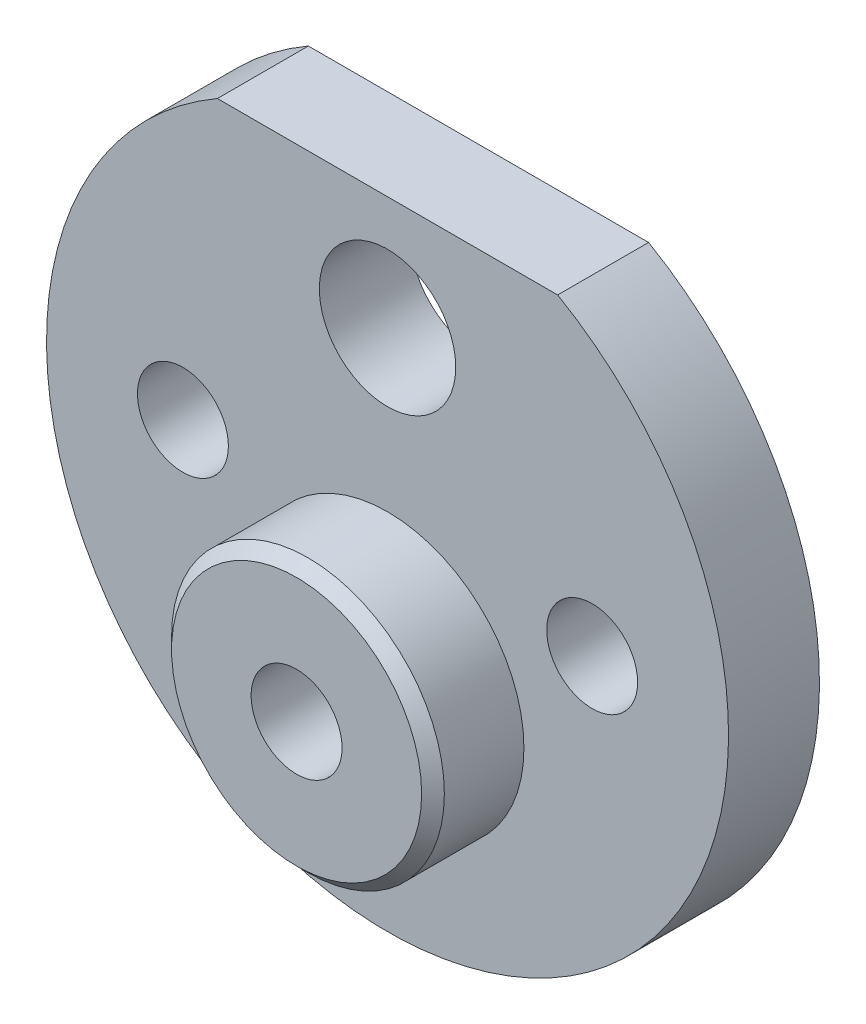
ISO-10303-21;
HEADER;
FILE_DESCRIPTION(('STEP AP214'),'2;1');
FILE_NAME('part.step','',(''),(''),'','','');
FILE_SCHEMA(('AUTOMOTIVE_DESIGN { 1 0 10303 214 1 1 1 1 }'));
ENDSEC;
DATA;
#1=APPLICATION_CONTEXT('core data for automotive mechanical design processes');
#2=APPLICATION_PROTOCOL_DEFINITION('international standard','automotive_design',2000,#1);
#3=PRODUCT_CONTEXT('',#1,'mechanical');
#4=PRODUCT('Part','Part','',(#3));
#5=PRODUCT_RELATED_PRODUCT_CATEGORY('part','',(#4));
#6=PRODUCT_DEFINITION_FORMATION('','',#4);
#7=PRODUCT_DEFINITION_CONTEXT('part definition',#1,'design');
#8=PRODUCT_DEFINITION('design','',#6,#7);
#9=PRODUCT_DEFINITION_SHAPE('','',#8);
#10=(LENGTH_UNIT() NAMED_UNIT(*) SI_UNIT(.MILLI.,.METRE.));
#11=(NAMED_UNIT(*) PLANE_ANGLE_UNIT() SI_UNIT($,.RADIAN.));
#12=(NAMED_UNIT(*) SI_UNIT($,.STERADIAN.) SOLID_ANGLE_UNIT());
#13=UNCERTAINTY_MEASURE_WITH_UNIT(LENGTH_MEASURE(1.E-05),#10,'distance_accuracy_value','');
#14=(GEOMETRIC_REPRESENTATION_CONTEXT(3) GLOBAL_UNCERTAINTY_ASSIGNED_CONTEXT((#13)) GLOBAL_UNIT_ASSIGNED_CONTEXT((#10,
#11,#12)) REPRESENTATION_CONTEXT('',''));
#15=CARTESIAN_POINT('',(0.,0.,0.));
#16=DIRECTION('',(0.,0.,1.));
#17=DIRECTION('',(1.,0.,0.));
#18=AXIS2_PLACEMENT_3D('',#15,#16,#17);
#19=CARTESIAN_POINT('',(0.,0.,4.));
#20=DIRECTION('',(0.,0.,1.));
#21=DIRECTION('',(1.,0.,0.));
#22=AXIS2_PLACEMENT_3D('',#19,#20,#21);
#23=PLANE('',#22);
#24=CARTESIAN_POINT('',(0.,-5.,4.));
#25=DIRECTION('',(0.,0.,1.));
#26=DIRECTION('',(1.,0.,0.));
#27=AXIS2_PLACEMENT_3D('',#24,#25,#26);
#28=CIRCLE('',#27,6.);
#29=CARTESIAN_POINT('',(6.,-5.,4.));
#30=VERTEX_POINT('',#29);
#31=EDGE_CURVE('E92',#30,#30,#28,.T.);
#32=ORIENTED_EDGE('',*,*,#31,.F.);
#33=EDGE_LOOP('',(#32));
#34=FACE_BOUND('',#33,.T.);
#35=CARTESIAN_POINT('',(9.,0.,4.));
#36=DIRECTION('',(0.,0.,1.));
#37=DIRECTION('',(1.,0.,0.));
#38=AXIS2_PLACEMENT_3D('',#35,#36,#37);
#39=CIRCLE('',#38,2.);
#40=CARTESIAN_POINT('',(11.,0.,4.));
#41=VERTEX_POINT('',#40);
#42=EDGE_CURVE('E112',#41,#41,#39,.T.);
#43=ORIENTED_EDGE('',*,*,#42,.F.);
#44=EDGE_LOOP('',(#43));
#45=FACE_BOUND('',#44,.T.);
#46=CARTESIAN_POINT('',(0.,0.,4.));
#47=DIRECTION('',(0.,0.,1.));
#48=DIRECTION('',(1.,0.,0.));
#49=AXIS2_PLACEMENT_3D('',#46,#47,#48);
#50=CIRCLE('',#49,15.);
#51=CARTESIAN_POINT('',(-7.48331477354788,13.,4.));
#52=VERTEX_POINT('',#51);
#53=CARTESIAN_POINT('',(7.48331477354788,13.,4.));
#54=VERTEX_POINT('',#53);
#55=EDGE_CURVE('E76',#52,#54,#50,.T.);
#56=ORIENTED_EDGE('',*,*,#55,.T.);
#57=DIRECTION('',(-1.,0.,0.));
#58=VECTOR('',#57,1.);
#59=CARTESIAN_POINT('',(-7.48331477354788,13.,4.));
#60=LINE('',#59,#58);
#61=EDGE_CURVE('E58',#54,#52,#60,.T.);
#62=ORIENTED_EDGE('',*,*,#61,.T.);
#63=EDGE_LOOP('',(#56,#62));
#64=FACE_BOUND('',#63,.T.);
#65=CARTESIAN_POINT('',(0.,8.,4.));
#66=DIRECTION('',(0.,0.,1.));
#67=DIRECTION('',(1.,0.,0.));
#68=AXIS2_PLACEMENT_3D('',#65,#66,#67);
#69=CIRCLE('',#68,3.);
#70=CARTESIAN_POINT('',(3.,8.,4.));
#71=VERTEX_POINT('',#70);
#72=EDGE_CURVE('E84',#71,#71,#69,.T.);
#73=ORIENTED_EDGE('',*,*,#72,.F.);
#74=EDGE_LOOP('',(#73));
#75=FACE_BOUND('',#74,.T.);
#76=CARTESIAN_POINT('',(-9.,0.,4.));
#77=DIRECTION('',(0.,0.,1.));
#78=DIRECTION('',(1.,0.,0.));
#79=AXIS2_PLACEMENT_3D('',#76,#77,#78);
#80=CIRCLE('',#79,2.);
#81=CARTESIAN_POINT('',(-7.,0.,4.));
#82=VERTEX_POINT('',#81);
#83=EDGE_CURVE('E104',#82,#82,#80,.T.);
#84=ORIENTED_EDGE('',*,*,#83,.F.);
#85=EDGE_LOOP('',(#84));
#86=FACE_BOUND('',#85,.T.);
#87=ADVANCED_FACE('F41',(#34,#45,#64,#75,#86),#23,.T.);
#88=CARTESIAN_POINT('',(0.,0.,0.));
#89=DIRECTION('',(0.,0.,1.));
#90=DIRECTION('',(1.,0.,0.));
#91=AXIS2_PLACEMENT_3D('',#88,#89,#90);
#92=PLANE('',#91);
#93=CARTESIAN_POINT('',(0.,-5.,0.));
#94=DIRECTION('',(0.,0.,1.));
#95=DIRECTION('',(1.,0.,0.));
#96=AXIS2_PLACEMENT_3D('',#93,#94,#95);
#97=CIRCLE('',#96,2.);
#98=CARTESIAN_POINT('',(2.,-5.,0.));
#99=VERTEX_POINT('',#98);
#100=EDGE_CURVE('E111',#99,#99,#97,.T.);
#101=ORIENTED_EDGE('',*,*,#100,.T.);
#102=EDGE_LOOP('',(#101));
#103=FACE_BOUND('',#102,.T.);
#104=CARTESIAN_POINT('',(0.,0.,0.));
#105=DIRECTION('',(0.,0.,1.));
#106=DIRECTION('',(1.,0.,0.));
#107=AXIS2_PLACEMENT_3D('',#104,#105,#106);
#108=CIRCLE('',#107,15.);
#109=CARTESIAN_POINT('',(-7.48331477354788,13.,0.));
#110=VERTEX_POINT('',#109);
#111=CARTESIAN_POINT('',(7.48331477354788,13.,0.));
#112=VERTEX_POINT('',#111);
#113=EDGE_CURVE('E77',#110,#112,#108,.T.);
#114=ORIENTED_EDGE('',*,*,#113,.F.);
#115=DIRECTION('',(-1.,0.,0.));
#116=VECTOR('',#115,1.);
#117=CARTESIAN_POINT('',(-7.48331477354788,13.,0.));
#118=LINE('',#117,#116);
#119=EDGE_CURVE('E66',#112,#110,#118,.T.);
#120=ORIENTED_EDGE('',*,*,#119,.F.);
#121=EDGE_LOOP('',(#114,#120));
#122=FACE_BOUND('',#121,.T.);
#123=CARTESIAN_POINT('',(0.,8.,0.));
#124=DIRECTION('',(0.,0.,1.));
#125=DIRECTION('',(1.,0.,0.));
#126=AXIS2_PLACEMENT_3D('',#123,#124,#125);
#127=CIRCLE('',#126,3.);
#128=CARTESIAN_POINT('',(3.,8.,0.));
#129=VERTEX_POINT('',#128);
#130=EDGE_CURVE('E87',#129,#129,#127,.T.);
#131=ORIENTED_EDGE('',*,*,#130,.T.);
#132=EDGE_LOOP('',(#131));
#133=FACE_BOUND('',#132,.T.);
#134=CARTESIAN_POINT('',(9.,0.,0.));
#135=DIRECTION('',(0.,0.,1.));
#136=DIRECTION('',(1.,0.,0.));
#137=AXIS2_PLACEMENT_3D('',#134,#135,#136);
#138=CIRCLE('',#137,2.);
#139=CARTESIAN_POINT('',(11.,0.,0.));
#140=VERTEX_POINT('',#139);
#141=EDGE_CURVE('E107',#140,#140,#138,.T.);
#142=ORIENTED_EDGE('',*,*,#141,.T.);
#143=EDGE_LOOP('',(#142));
#144=FACE_BOUND('',#143,.T.);
#145=CARTESIAN_POINT('',(-9.,0.,0.));
#146=DIRECTION('',(0.,0.,1.));
#147=DIRECTION('',(1.,0.,0.));
#148=AXIS2_PLACEMENT_3D('',#145,#146,#147);
#149=CIRCLE('',#148,2.);
#150=CARTESIAN_POINT('',(-7.,0.,0.));
#151=VERTEX_POINT('',#150);
#152=EDGE_CURVE('E108',#151,#151,#149,.T.);
#153=ORIENTED_EDGE('',*,*,#152,.T.);
#154=EDGE_LOOP('',(#153));
#155=FACE_BOUND('',#154,.T.);
#156=ADVANCED_FACE('F82',(#103,#122,#133,#144,#155),#92,.F.);
#157=CARTESIAN_POINT('',(0.,0.,4.));
#158=DIRECTION('',(0.,0.,-1.));
#159=DIRECTION('',(-1.,0.,0.));
#160=AXIS2_PLACEMENT_3D('',#157,#158,#159);
#161=CYLINDRICAL_SURFACE('',#160,15.);
#162=ORIENTED_EDGE('',*,*,#113,.T.);
#163=DIRECTION('',(0.,0.,-1.));
#164=VECTOR('',#163,1.);
#165=CARTESIAN_POINT('',(7.48331477354788,13.,4.));
#166=LINE('',#165,#164);
#167=EDGE_CURVE('E74',#54,#112,#166,.T.);
#168=ORIENTED_EDGE('',*,*,#167,.F.);
#169=ORIENTED_EDGE('',*,*,#55,.F.);
#170=DIRECTION('',(0.,0.,-1.));
#171=VECTOR('',#170,1.);
#172=CARTESIAN_POINT('',(-7.48331477354788,13.,4.));
#173=LINE('',#172,#171);
#174=EDGE_CURVE('E71',#52,#110,#173,.T.);
#175=ORIENTED_EDGE('',*,*,#174,.T.);
#176=EDGE_LOOP('',(#162,#168,#169,#175));
#177=FACE_BOUND('',#176,.T.);
#178=ADVANCED_FACE('F80',(#177),#161,.T.);
#179=CARTESIAN_POINT('',(-7.48331477354788,13.,4.));
#180=DIRECTION('',(0.,-1.,0.));
#181=DIRECTION('',(0.,0.,-1.));
#182=AXIS2_PLACEMENT_3D('',#179,#180,#181);
#183=PLANE('',#182);
#184=ORIENTED_EDGE('',*,*,#119,.T.);
#185=ORIENTED_EDGE('',*,*,#174,.F.);
#186=ORIENTED_EDGE('',*,*,#61,.F.);
#187=ORIENTED_EDGE('',*,*,#167,.T.);
#188=EDGE_LOOP('',(#184,#185,#186,#187));
#189=FACE_BOUND('',#188,.T.);
#190=ADVANCED_FACE('F70',(#189),#183,.F.);
#191=CARTESIAN_POINT('',(0.,8.,4.));
#192=DIRECTION('',(0.,0.,-1.));
#193=DIRECTION('',(-1.,0.,0.));
#194=AXIS2_PLACEMENT_3D('',#191,#192,#193);
#195=CYLINDRICAL_SURFACE('',#194,3.);
#196=ORIENTED_EDGE('',*,*,#72,.T.);
#197=EDGE_LOOP('',(#196));
#198=FACE_BOUND('',#197,.T.);
#199=ORIENTED_EDGE('',*,*,#130,.F.);
#200=EDGE_LOOP('',(#199));
#201=FACE_BOUND('',#200,.T.);
#202=ADVANCED_FACE('F146',(#198,#201),#195,.F.);
#203=CARTESIAN_POINT('',(9.,0.,4.));
#204=DIRECTION('',(0.,0.,-1.));
#205=DIRECTION('',(-1.,0.,0.));
#206=AXIS2_PLACEMENT_3D('',#203,#204,#205);
#207=CYLINDRICAL_SURFACE('',#206,2.);
#208=ORIENTED_EDGE('',*,*,#42,.T.);
#209=EDGE_LOOP('',(#208));
#210=FACE_BOUND('',#209,.T.);
#211=ORIENTED_EDGE('',*,*,#141,.F.);
#212=EDGE_LOOP('',(#211));
#213=FACE_BOUND('',#212,.T.);
#214=ADVANCED_FACE('F130',(#210,#213),#207,.F.);
#215=CARTESIAN_POINT('',(-9.,0.,4.));
#216=DIRECTION('',(0.,0.,-1.));
#217=DIRECTION('',(-1.,0.,0.));
#218=AXIS2_PLACEMENT_3D('',#215,#216,#217);
#219=CYLINDRICAL_SURFACE('',#218,2.);
#220=ORIENTED_EDGE('',*,*,#83,.T.);
#221=EDGE_LOOP('',(#220));
#222=FACE_BOUND('',#221,.T.);
#223=ORIENTED_EDGE('',*,*,#152,.F.);
#224=EDGE_LOOP('',(#223));
#225=FACE_BOUND('',#224,.T.);
#226=ADVANCED_FACE('F126',(#222,#225),#219,.F.);
#227=CARTESIAN_POINT('',(0.,-5.,8.));
#228=DIRECTION('',(0.,0.,-1.));
#229=DIRECTION('',(-1.,0.,0.));
#230=AXIS2_PLACEMENT_3D('',#227,#228,#229);
#231=CYLINDRICAL_SURFACE('',#230,6.);
#232=CARTESIAN_POINT('',(0.,-5.,7.5));
#233=DIRECTION('',(0.,0.,1.));
#234=DIRECTION('',(1.,0.,0.));
#235=AXIS2_PLACEMENT_3D('',#232,#233,#234);
#236=CIRCLE('',#235,6.);
#237=CARTESIAN_POINT('',(6.,-5.,7.5));
#238=VERTEX_POINT('',#237);
#239=EDGE_CURVE('E11',#238,#238,#236,.F.);
#240=ORIENTED_EDGE('',*,*,#239,.T.);
#241=EDGE_LOOP('',(#240));
#242=FACE_BOUND('',#241,.T.);
#243=ORIENTED_EDGE('',*,*,#31,.T.);
#244=EDGE_LOOP('',(#243));
#245=FACE_BOUND('',#244,.T.);
#246=ADVANCED_FACE('F129',(#242,#245),#231,.T.);
#247=CARTESIAN_POINT('',(0.,-5.,8.));
#248=DIRECTION('',(0.,0.,1.));
#249=DIRECTION('',(1.,0.,0.));
#250=AXIS2_PLACEMENT_3D('',#247,#248,#249);
#251=PLANE('',#250);
#252=CARTESIAN_POINT('',(0.,-5.,8.));
#253=DIRECTION('',(0.,0.,1.));
#254=DIRECTION('',(1.,0.,0.));
#255=AXIS2_PLACEMENT_3D('',#252,#253,#254);
#256=CIRCLE('',#255,2.);
#257=CARTESIAN_POINT('',(2.,-5.,8.));
#258=VERTEX_POINT('',#257);
#259=EDGE_CURVE('E102',#258,#258,#256,.T.);
#260=ORIENTED_EDGE('',*,*,#259,.F.);
#261=EDGE_LOOP('',(#260));
#262=FACE_BOUND('',#261,.T.);
#263=CARTESIAN_POINT('',(0.,-5.,8.));
#264=DIRECTION('',(0.,0.,1.));
#265=DIRECTION('',(1.,0.,0.));
#266=AXIS2_PLACEMENT_3D('',#263,#264,#265);
#267=CIRCLE('',#266,5.50000000000001);
#268=CARTESIAN_POINT('',(5.50000000000001,-5.,8.));
#269=VERTEX_POINT('',#268);
#270=EDGE_CURVE('E51',#269,#269,#267,.T.);
#271=ORIENTED_EDGE('',*,*,#270,.T.);
#272=EDGE_LOOP('',(#271));
#273=FACE_BOUND('',#272,.T.);
#274=ADVANCED_FACE('F160',(#262,#273),#251,.T.);
#275=CARTESIAN_POINT('',(0.,-5.,8.));
#276=DIRECTION('',(0.,0.,-1.));
#277=DIRECTION('',(-1.,0.,0.));
#278=AXIS2_PLACEMENT_3D('',#275,#276,#277);
#279=CONICAL_SURFACE('',#278,5.50000000000001,0.785398163397447);
#280=ORIENTED_EDGE('',*,*,#239,.F.);
#281=EDGE_LOOP('',(#280));
#282=FACE_BOUND('',#281,.T.);
#283=ORIENTED_EDGE('',*,*,#270,.F.);
#284=EDGE_LOOP('',(#283));
#285=FACE_BOUND('',#284,.T.);
#286=ADVANCED_FACE('F44',(#282,#285),#279,.T.);
#287=CARTESIAN_POINT('',(0.,-5.,0.));
#288=DIRECTION('',(0.,0.,1.));
#289=DIRECTION('',(1.,0.,0.));
#290=AXIS2_PLACEMENT_3D('',#287,#288,#289);
#291=CYLINDRICAL_SURFACE('',#290,2.);
#292=ORIENTED_EDGE('',*,*,#100,.F.);
#293=EDGE_LOOP('',(#292));
#294=FACE_BOUND('',#293,.T.);
#295=ORIENTED_EDGE('',*,*,#259,.T.);
#296=EDGE_LOOP('',(#295));
#297=FACE_BOUND('',#296,.T.);
#298=ADVANCED_FACE('F164',(#294,#297),#291,.F.);
#299=CLOSED_SHELL('',(#87,#156,#178,#190,#202,#214,#226,#246,#274,#286,#298));
#300=MANIFOLD_SOLID_BREP('B2',#299);
#301=ADVANCED_BREP_SHAPE_REPRESENTATION('',(#18,#300),#14);
#302=SHAPE_DEFINITION_REPRESENTATION(#9,#301);
ENDSEC;
END-ISO-10303-21;
